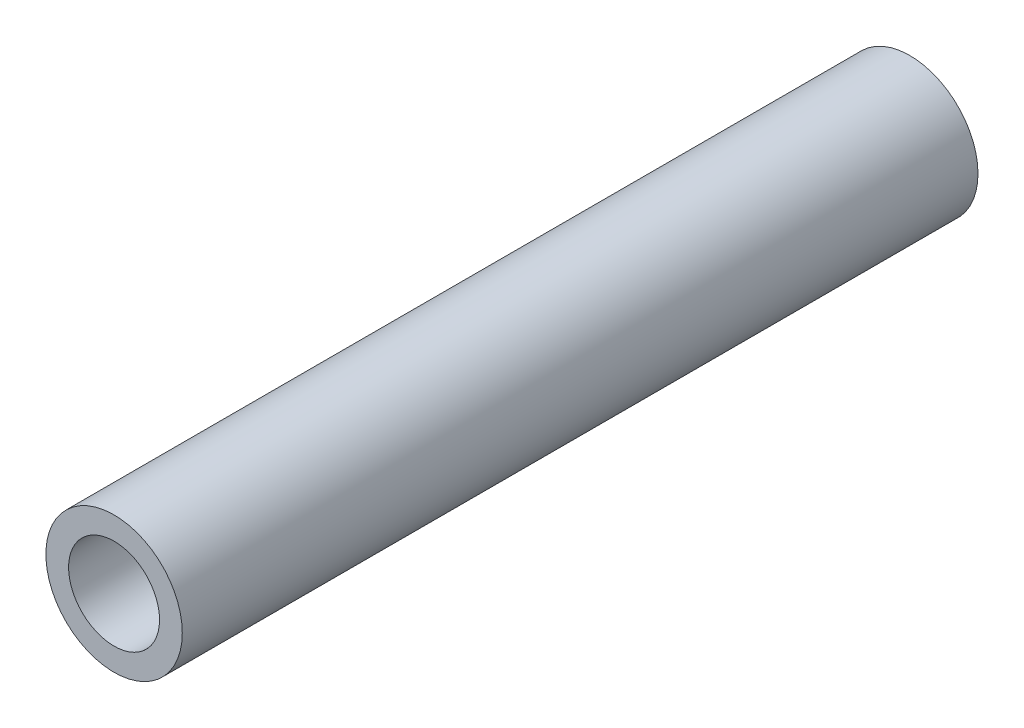
ISO-10303-21;
HEADER;
FILE_DESCRIPTION(('STEP AP214'),'2;1');
FILE_NAME('part.step','',(''),(''),'','','');
FILE_SCHEMA(('AUTOMOTIVE_DESIGN { 1 0 10303 214 1 1 1 1 }'));
ENDSEC;
DATA;
#1=APPLICATION_CONTEXT('core data for automotive mechanical design processes');
#2=APPLICATION_PROTOCOL_DEFINITION('international standard','automotive_design',2000,#1);
#3=PRODUCT_CONTEXT('',#1,'mechanical');
#4=PRODUCT('Part','Part','',(#3));
#5=PRODUCT_RELATED_PRODUCT_CATEGORY('part','',(#4));
#6=PRODUCT_DEFINITION_FORMATION('','',#4);
#7=PRODUCT_DEFINITION_CONTEXT('part definition',#1,'design');
#8=PRODUCT_DEFINITION('design','',#6,#7);
#9=PRODUCT_DEFINITION_SHAPE('','',#8);
#10=(LENGTH_UNIT() NAMED_UNIT(*) SI_UNIT(.MILLI.,.METRE.));
#11=(NAMED_UNIT(*) PLANE_ANGLE_UNIT() SI_UNIT($,.RADIAN.));
#12=(NAMED_UNIT(*) SI_UNIT($,.STERADIAN.) SOLID_ANGLE_UNIT());
#13=UNCERTAINTY_MEASURE_WITH_UNIT(LENGTH_MEASURE(1.E-05),#10,'distance_accuracy_value','');
#14=(GEOMETRIC_REPRESENTATION_CONTEXT(3) GLOBAL_UNCERTAINTY_ASSIGNED_CONTEXT((#13)) GLOBAL_UNIT_ASSIGNED_CONTEXT((#10,
#11,#12)) REPRESENTATION_CONTEXT('',''));
#15=CARTESIAN_POINT('',(0.,0.,0.));
#16=DIRECTION('',(0.,0.,1.));
#17=DIRECTION('',(1.,0.,0.));
#18=AXIS2_PLACEMENT_3D('',#15,#16,#17);
#19=CARTESIAN_POINT('',(0.,0.,17.5));
#20=DIRECTION('',(0.,0.,1.));
#21=DIRECTION('',(1.,0.,0.));
#22=AXIS2_PLACEMENT_3D('',#19,#20,#21);
#23=PLANE('',#22);
#24=CARTESIAN_POINT('',(0.,0.,17.5));
#25=DIRECTION('',(0.,0.,1.));
#26=DIRECTION('',(1.,0.,0.));
#27=AXIS2_PLACEMENT_3D('',#24,#25,#26);
#28=CIRCLE('',#27,3.);
#29=CARTESIAN_POINT('',(3.,0.,17.5));
#30=VERTEX_POINT('',#29);
#31=EDGE_CURVE('E10',#30,#30,#28,.T.);
#32=ORIENTED_EDGE('',*,*,#31,.T.);
#33=EDGE_LOOP('',(#32));
#34=FACE_BOUND('',#33,.T.);
#35=CARTESIAN_POINT('',(0.,0.,17.5));
#36=DIRECTION('',(0.,0.,1.));
#37=DIRECTION('',(1.,0.,0.));
#38=AXIS2_PLACEMENT_3D('',#35,#36,#37);
#39=CIRCLE('',#38,2.);
#40=CARTESIAN_POINT('',(2.,0.,17.5));
#41=VERTEX_POINT('',#40);
#42=EDGE_CURVE('E42',#41,#41,#39,.T.);
#43=ORIENTED_EDGE('',*,*,#42,.F.);
#44=EDGE_LOOP('',(#43));
#45=FACE_BOUND('',#44,.T.);
#46=ADVANCED_FACE('F31',(#34,#45),#23,.T.);
#47=CARTESIAN_POINT('',(0.,0.,-17.5));
#48=DIRECTION('',(0.,0.,1.));
#49=DIRECTION('',(1.,0.,0.));
#50=AXIS2_PLACEMENT_3D('',#47,#48,#49);
#51=PLANE('',#50);
#52=CARTESIAN_POINT('',(0.,0.,-17.5));
#53=DIRECTION('',(0.,0.,1.));
#54=DIRECTION('',(1.,0.,0.));
#55=AXIS2_PLACEMENT_3D('',#52,#53,#54);
#56=CIRCLE('',#55,3.);
#57=CARTESIAN_POINT('',(3.,0.,-17.5));
#58=VERTEX_POINT('',#57);
#59=EDGE_CURVE('E35',#58,#58,#56,.T.);
#60=ORIENTED_EDGE('',*,*,#59,.F.);
#61=EDGE_LOOP('',(#60));
#62=FACE_BOUND('',#61,.T.);
#63=CARTESIAN_POINT('',(0.,0.,-17.5));
#64=DIRECTION('',(0.,0.,1.));
#65=DIRECTION('',(1.,0.,0.));
#66=AXIS2_PLACEMENT_3D('',#63,#64,#65);
#67=CIRCLE('',#66,2.);
#68=CARTESIAN_POINT('',(2.,0.,-17.5));
#69=VERTEX_POINT('',#68);
#70=EDGE_CURVE('E44',#69,#69,#67,.T.);
#71=ORIENTED_EDGE('',*,*,#70,.T.);
#72=EDGE_LOOP('',(#71));
#73=FACE_BOUND('',#72,.T.);
#74=ADVANCED_FACE('F54',(#62,#73),#51,.F.);
#75=CARTESIAN_POINT('',(0.,0.,17.5));
#76=DIRECTION('',(0.,0.,-1.));
#77=DIRECTION('',(-1.,0.,0.));
#78=AXIS2_PLACEMENT_3D('',#75,#76,#77);
#79=CYLINDRICAL_SURFACE('',#78,3.);
#80=ORIENTED_EDGE('',*,*,#31,.F.);
#81=EDGE_LOOP('',(#80));
#82=FACE_BOUND('',#81,.T.);
#83=ORIENTED_EDGE('',*,*,#59,.T.);
#84=EDGE_LOOP('',(#83));
#85=FACE_BOUND('',#84,.T.);
#86=ADVANCED_FACE('F33',(#82,#85),#79,.T.);
#87=CARTESIAN_POINT('',(0.,0.,17.5));
#88=DIRECTION('',(0.,0.,-1.));
#89=DIRECTION('',(-1.,0.,0.));
#90=AXIS2_PLACEMENT_3D('',#87,#88,#89);
#91=CYLINDRICAL_SURFACE('',#90,2.);
#92=ORIENTED_EDGE('',*,*,#42,.T.);
#93=EDGE_LOOP('',(#92));
#94=FACE_BOUND('',#93,.T.);
#95=ORIENTED_EDGE('',*,*,#70,.F.);
#96=EDGE_LOOP('',(#95));
#97=FACE_BOUND('',#96,.T.);
#98=ADVANCED_FACE('F50',(#94,#97),#91,.F.);
#99=CLOSED_SHELL('',(#46,#74,#86,#98));
#100=MANIFOLD_SOLID_BREP('B2',#99);
#101=ADVANCED_BREP_SHAPE_REPRESENTATION('',(#18,#100),#14);
#102=SHAPE_DEFINITION_REPRESENTATION(#9,#101);
ENDSEC;
END-ISO-10303-21;
